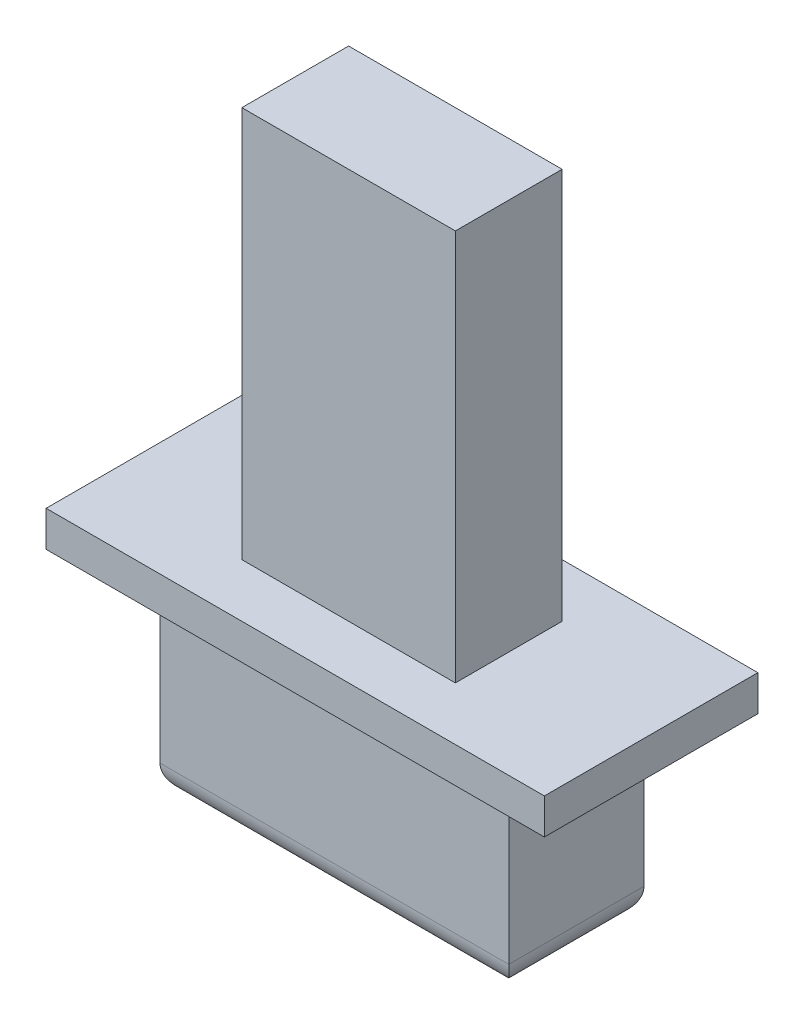
ISO-10303-21;
HEADER;
FILE_DESCRIPTION(('STEP AP214'),'2;1');
FILE_NAME('part.step','',(''),(''),'','','');
FILE_SCHEMA(('AUTOMOTIVE_DESIGN { 1 0 10303 214 1 1 1 1 }'));
ENDSEC;
DATA;
#1=APPLICATION_CONTEXT('core data for automotive mechanical design processes');
#2=APPLICATION_PROTOCOL_DEFINITION('international standard','automotive_design',2000,#1);
#3=PRODUCT_CONTEXT('',#1,'mechanical');
#4=PRODUCT('Part','Part','',(#3));
#5=PRODUCT_RELATED_PRODUCT_CATEGORY('part','',(#4));
#6=PRODUCT_DEFINITION_FORMATION('','',#4);
#7=PRODUCT_DEFINITION_CONTEXT('part definition',#1,'design');
#8=PRODUCT_DEFINITION('design','',#6,#7);
#9=PRODUCT_DEFINITION_SHAPE('','',#8);
#10=(LENGTH_UNIT() NAMED_UNIT(*) SI_UNIT(.MILLI.,.METRE.));
#11=(NAMED_UNIT(*) PLANE_ANGLE_UNIT() SI_UNIT($,.RADIAN.));
#12=(NAMED_UNIT(*) SI_UNIT($,.STERADIAN.) SOLID_ANGLE_UNIT());
#13=UNCERTAINTY_MEASURE_WITH_UNIT(LENGTH_MEASURE(1.E-05),#10,'distance_accuracy_value','');
#14=(GEOMETRIC_REPRESENTATION_CONTEXT(3) GLOBAL_UNCERTAINTY_ASSIGNED_CONTEXT((#13)) GLOBAL_UNIT_ASSIGNED_CONTEXT((#10,
#11,#12)) REPRESENTATION_CONTEXT('',''));
#15=CARTESIAN_POINT('',(0.,0.,0.));
#16=DIRECTION('',(0.,0.,1.));
#17=DIRECTION('',(1.,0.,0.));
#18=AXIS2_PLACEMENT_3D('',#15,#16,#17);
#19=CARTESIAN_POINT('',(3.5,3.25,1.5));
#20=DIRECTION('',(-1.,0.,0.));
#21=DIRECTION('',(0.,0.,1.));
#22=AXIS2_PLACEMENT_3D('',#19,#20,#21);
#23=PLANE('',#22);
#24=DIRECTION('',(0.,0.,-1.));
#25=VECTOR('',#24,1.);
#26=CARTESIAN_POINT('',(3.5,2.75,1.5));
#27=LINE('',#26,#25);
#28=CARTESIAN_POINT('',(3.5,2.75,1.5));
#29=VERTEX_POINT('',#28);
#30=CARTESIAN_POINT('',(3.5,2.75,-1.5));
#31=VERTEX_POINT('',#30);
#32=EDGE_CURVE('E110',#29,#31,#27,.T.);
#33=ORIENTED_EDGE('',*,*,#32,.T.);
#34=DIRECTION('',(0.,-1.,0.));
#35=VECTOR('',#34,1.);
#36=CARTESIAN_POINT('',(3.5,3.25,-1.5));
#37=LINE('',#36,#35);
#38=CARTESIAN_POINT('',(3.5,3.25,-1.5));
#39=VERTEX_POINT('',#38);
#40=EDGE_CURVE('E12',#39,#31,#37,.T.);
#41=ORIENTED_EDGE('',*,*,#40,.F.);
#42=DIRECTION('',(0.,0.,-1.));
#43=VECTOR('',#42,1.);
#44=CARTESIAN_POINT('',(3.5,3.25,1.5));
#45=LINE('',#44,#43);
#46=CARTESIAN_POINT('',(3.5,3.25,1.5));
#47=VERTEX_POINT('',#46);
#48=EDGE_CURVE('E98',#47,#39,#45,.T.);
#49=ORIENTED_EDGE('',*,*,#48,.F.);
#50=DIRECTION('',(0.,-1.,0.));
#51=VECTOR('',#50,1.);
#52=CARTESIAN_POINT('',(3.5,3.25,1.5));
#53=LINE('',#52,#51);
#54=EDGE_CURVE('E106',#47,#29,#53,.T.);
#55=ORIENTED_EDGE('',*,*,#54,.T.);
#56=EDGE_LOOP('',(#33,#41,#49,#55));
#57=FACE_BOUND('',#56,.T.);
#58=ADVANCED_FACE('F47',(#57),#23,.F.);
#59=CARTESIAN_POINT('',(-3.5,3.25,-1.5));
#60=DIRECTION('',(0.,0.,1.));
#61=DIRECTION('',(1.,0.,0.));
#62=AXIS2_PLACEMENT_3D('',#59,#60,#61);
#63=PLANE('',#62);
#64=DIRECTION('',(-1.,0.,0.));
#65=VECTOR('',#64,1.);
#66=CARTESIAN_POINT('',(-3.5,2.75,-1.5));
#67=LINE('',#66,#65);
#68=CARTESIAN_POINT('',(-3.5,2.75,-1.5));
#69=VERTEX_POINT('',#68);
#70=EDGE_CURVE('E102',#31,#69,#67,.T.);
#71=ORIENTED_EDGE('',*,*,#70,.T.);
#72=DIRECTION('',(0.,-1.,0.));
#73=VECTOR('',#72,1.);
#74=CARTESIAN_POINT('',(-3.5,3.25,-1.5));
#75=LINE('',#74,#73);
#76=CARTESIAN_POINT('',(-3.5,3.25,-1.5));
#77=VERTEX_POINT('',#76);
#78=EDGE_CURVE('E55',#77,#69,#75,.T.);
#79=ORIENTED_EDGE('',*,*,#78,.F.);
#80=DIRECTION('',(-1.,0.,0.));
#81=VECTOR('',#80,1.);
#82=CARTESIAN_POINT('',(-3.5,3.25,-1.5));
#83=LINE('',#82,#81);
#84=EDGE_CURVE('E93',#39,#77,#83,.T.);
#85=ORIENTED_EDGE('',*,*,#84,.F.);
#86=ORIENTED_EDGE('',*,*,#40,.T.);
#87=EDGE_LOOP('',(#71,#79,#85,#86));
#88=FACE_BOUND('',#87,.T.);
#89=ADVANCED_FACE('F101',(#88),#63,.F.);
#90=CARTESIAN_POINT('',(-3.5,3.25,1.5));
#91=DIRECTION('',(1.,0.,0.));
#92=DIRECTION('',(0.,0.,-1.));
#93=AXIS2_PLACEMENT_3D('',#90,#91,#92);
#94=PLANE('',#93);
#95=DIRECTION('',(0.,0.,1.));
#96=VECTOR('',#95,1.);
#97=CARTESIAN_POINT('',(-3.5,2.75,1.5));
#98=LINE('',#97,#96);
#99=CARTESIAN_POINT('',(-3.5,2.75,1.5));
#100=VERTEX_POINT('',#99);
#101=EDGE_CURVE('E80',#69,#100,#98,.T.);
#102=ORIENTED_EDGE('',*,*,#101,.T.);
#103=DIRECTION('',(0.,-1.,0.));
#104=VECTOR('',#103,1.);
#105=CARTESIAN_POINT('',(-3.5,3.25,1.5));
#106=LINE('',#105,#104);
#107=CARTESIAN_POINT('',(-3.5,3.25,1.5));
#108=VERTEX_POINT('',#107);
#109=EDGE_CURVE('E103',#108,#100,#106,.T.);
#110=ORIENTED_EDGE('',*,*,#109,.F.);
#111=DIRECTION('',(0.,0.,1.));
#112=VECTOR('',#111,1.);
#113=CARTESIAN_POINT('',(-3.5,3.25,1.5));
#114=LINE('',#113,#112);
#115=EDGE_CURVE('E96',#77,#108,#114,.T.);
#116=ORIENTED_EDGE('',*,*,#115,.F.);
#117=ORIENTED_EDGE('',*,*,#78,.T.);
#118=EDGE_LOOP('',(#102,#110,#116,#117));
#119=FACE_BOUND('',#118,.T.);
#120=ADVANCED_FACE('F104',(#119),#94,.F.);
#121=CARTESIAN_POINT('',(-3.5,3.25,1.5));
#122=DIRECTION('',(0.,0.,-1.));
#123=DIRECTION('',(-1.,0.,0.));
#124=AXIS2_PLACEMENT_3D('',#121,#122,#123);
#125=PLANE('',#124);
#126=DIRECTION('',(1.,0.,0.));
#127=VECTOR('',#126,1.);
#128=CARTESIAN_POINT('',(-3.5,2.75,1.5));
#129=LINE('',#128,#127);
#130=EDGE_CURVE('E86',#100,#29,#129,.T.);
#131=ORIENTED_EDGE('',*,*,#130,.T.);
#132=ORIENTED_EDGE('',*,*,#54,.F.);
#133=DIRECTION('',(1.,0.,0.));
#134=VECTOR('',#133,1.);
#135=CARTESIAN_POINT('',(-3.5,3.25,1.5));
#136=LINE('',#135,#134);
#137=EDGE_CURVE('E63',#108,#47,#136,.T.);
#138=ORIENTED_EDGE('',*,*,#137,.F.);
#139=ORIENTED_EDGE('',*,*,#109,.T.);
#140=EDGE_LOOP('',(#131,#132,#138,#139));
#141=FACE_BOUND('',#140,.T.);
#142=ADVANCED_FACE('F117',(#141),#125,.F.);
#143=CARTESIAN_POINT('',(0.,3.25,0.));
#144=DIRECTION('',(0.,-1.,0.));
#145=DIRECTION('',(0.,0.,-1.));
#146=AXIS2_PLACEMENT_3D('',#143,#144,#145);
#147=PLANE('',#146);
#148=ORIENTED_EDGE('',*,*,#48,.T.);
#149=ORIENTED_EDGE('',*,*,#84,.T.);
#150=ORIENTED_EDGE('',*,*,#115,.T.);
#151=ORIENTED_EDGE('',*,*,#137,.T.);
#152=EDGE_LOOP('',(#148,#149,#150,#151));
#153=FACE_BOUND('',#152,.T.);
#154=ADVANCED_FACE('F94',(#153),#147,.F.);
#155=CARTESIAN_POINT('',(0.,2.75,0.));
#156=DIRECTION('',(0.,-1.,0.));
#157=DIRECTION('',(0.,0.,-1.));
#158=AXIS2_PLACEMENT_3D('',#155,#156,#157);
#159=PLANE('',#158);
#160=ORIENTED_EDGE('',*,*,#32,.F.);
#161=ORIENTED_EDGE('',*,*,#130,.F.);
#162=ORIENTED_EDGE('',*,*,#101,.F.);
#163=ORIENTED_EDGE('',*,*,#70,.F.);
#164=EDGE_LOOP('',(#160,#161,#162,#163));
#165=FACE_BOUND('',#164,.T.);
#166=ADVANCED_FACE('F120',(#165),#159,.T.);
#167=CLOSED_SHELL('',(#58,#89,#120,#142,#154,#166));
#168=MANIFOLD_SOLID_BREP('B2',#167);
#169=CARTESIAN_POINT('',(-2.45,2.75,0.95));
#170=DIRECTION('',(1.,0.,0.));
#171=DIRECTION('',(0.,0.,-1.));
#172=AXIS2_PLACEMENT_3D('',#169,#170,#171);
#173=PLANE('',#172);
#174=DIRECTION('',(0.,-1.,0.));
#175=VECTOR('',#174,1.);
#176=CARTESIAN_POINT('',(-2.45,2.75,-0.95));
#177=LINE('',#176,#175);
#178=CARTESIAN_POINT('',(-2.45,2.75,-0.95));
#179=VERTEX_POINT('',#178);
#180=CARTESIAN_POINT('',(-2.45,0.4,-0.95));
#181=VERTEX_POINT('',#180);
#182=EDGE_CURVE('E290',#179,#181,#177,.T.);
#183=ORIENTED_EDGE('',*,*,#182,.T.);
#184=DIRECTION('',(0.,0.,1.));
#185=VECTOR('',#184,1.);
#186=CARTESIAN_POINT('',(-2.45,0.4,0.95));
#187=LINE('',#186,#185);
#188=CARTESIAN_POINT('',(-2.45,0.4,0.95));
#189=VERTEX_POINT('',#188);
#190=EDGE_CURVE('E45',#181,#189,#187,.T.);
#191=ORIENTED_EDGE('',*,*,#190,.T.);
#192=DIRECTION('',(0.,-1.,0.));
#193=VECTOR('',#192,1.);
#194=CARTESIAN_POINT('',(-2.45,2.75,0.95));
#195=LINE('',#194,#193);
#196=CARTESIAN_POINT('',(-2.45,2.75,0.95));
#197=VERTEX_POINT('',#196);
#198=EDGE_CURVE('E296',#197,#189,#195,.T.);
#199=ORIENTED_EDGE('',*,*,#198,.F.);
#200=DIRECTION('',(0.,0.,1.));
#201=VECTOR('',#200,1.);
#202=CARTESIAN_POINT('',(-2.45,2.75,0.95));
#203=LINE('',#202,#201);
#204=EDGE_CURVE('E276',#179,#197,#203,.T.);
#205=ORIENTED_EDGE('',*,*,#204,.F.);
#206=EDGE_LOOP('',(#183,#191,#199,#205));
#207=FACE_BOUND('',#206,.T.);
#208=ADVANCED_FACE('F171',(#207),#173,.F.);
#209=CARTESIAN_POINT('',(2.45,2.75,0.95));
#210=DIRECTION('',(0.,0.,-1.));
#211=DIRECTION('',(-1.,0.,0.));
#212=AXIS2_PLACEMENT_3D('',#209,#210,#211);
#213=PLANE('',#212);
#214=ORIENTED_EDGE('',*,*,#198,.T.);
#215=DIRECTION('',(1.,0.,0.));
#216=VECTOR('',#215,1.);
#217=CARTESIAN_POINT('',(2.45,0.4,0.95));
#218=LINE('',#217,#216);
#219=CARTESIAN_POINT('',(2.45,0.4,0.95));
#220=VERTEX_POINT('',#219);
#221=EDGE_CURVE('E299',#189,#220,#218,.T.);
#222=ORIENTED_EDGE('',*,*,#221,.T.);
#223=DIRECTION('',(0.,-1.,0.));
#224=VECTOR('',#223,1.);
#225=CARTESIAN_POINT('',(2.45,2.75,0.95));
#226=LINE('',#225,#224);
#227=CARTESIAN_POINT('',(2.45,2.75,0.95));
#228=VERTEX_POINT('',#227);
#229=EDGE_CURVE('E294',#228,#220,#226,.T.);
#230=ORIENTED_EDGE('',*,*,#229,.F.);
#231=DIRECTION('',(1.,0.,0.));
#232=VECTOR('',#231,1.);
#233=CARTESIAN_POINT('',(2.45,2.75,0.95));
#234=LINE('',#233,#232);
#235=EDGE_CURVE('E279',#197,#228,#234,.T.);
#236=ORIENTED_EDGE('',*,*,#235,.F.);
#237=EDGE_LOOP('',(#214,#222,#230,#236));
#238=FACE_BOUND('',#237,.T.);
#239=ADVANCED_FACE('F358',(#238),#213,.F.);
#240=CARTESIAN_POINT('',(2.45,2.75,0.95));
#241=DIRECTION('',(-1.,0.,0.));
#242=DIRECTION('',(0.,0.,1.));
#243=AXIS2_PLACEMENT_3D('',#240,#241,#242);
#244=PLANE('',#243);
#245=ORIENTED_EDGE('',*,*,#229,.T.);
#246=DIRECTION('',(0.,0.,-1.));
#247=VECTOR('',#246,1.);
#248=CARTESIAN_POINT('',(2.45,0.4,0.95));
#249=LINE('',#248,#247);
#250=CARTESIAN_POINT('',(2.45,0.4,-0.95));
#251=VERTEX_POINT('',#250);
#252=EDGE_CURVE('E195',#220,#251,#249,.T.);
#253=ORIENTED_EDGE('',*,*,#252,.T.);
#254=DIRECTION('',(0.,-1.,0.));
#255=VECTOR('',#254,1.);
#256=CARTESIAN_POINT('',(2.45,2.75,-0.95));
#257=LINE('',#256,#255);
#258=CARTESIAN_POINT('',(2.45,2.75,-0.95));
#259=VERTEX_POINT('',#258);
#260=EDGE_CURVE('E292',#259,#251,#257,.T.);
#261=ORIENTED_EDGE('',*,*,#260,.F.);
#262=DIRECTION('',(0.,0.,-1.));
#263=VECTOR('',#262,1.);
#264=CARTESIAN_POINT('',(2.45,2.75,0.95));
#265=LINE('',#264,#263);
#266=EDGE_CURVE('E286',#228,#259,#265,.T.);
#267=ORIENTED_EDGE('',*,*,#266,.F.);
#268=EDGE_LOOP('',(#245,#253,#261,#267));
#269=FACE_BOUND('',#268,.T.);
#270=ADVANCED_FACE('F378',(#269),#244,.F.);
#271=CARTESIAN_POINT('',(2.45,2.75,-0.95));
#272=DIRECTION('',(0.,0.,1.));
#273=DIRECTION('',(1.,0.,0.));
#274=AXIS2_PLACEMENT_3D('',#271,#272,#273);
#275=PLANE('',#274);
#276=ORIENTED_EDGE('',*,*,#260,.T.);
#277=DIRECTION('',(-1.,0.,0.));
#278=VECTOR('',#277,1.);
#279=CARTESIAN_POINT('',(2.45,0.4,-0.95));
#280=LINE('',#279,#278);
#281=EDGE_CURVE('E180',#251,#181,#280,.T.);
#282=ORIENTED_EDGE('',*,*,#281,.T.);
#283=ORIENTED_EDGE('',*,*,#182,.F.);
#284=DIRECTION('',(-1.,0.,0.));
#285=VECTOR('',#284,1.);
#286=CARTESIAN_POINT('',(2.45,2.75,-0.95));
#287=LINE('',#286,#285);
#288=EDGE_CURVE('E288',#259,#179,#287,.T.);
#289=ORIENTED_EDGE('',*,*,#288,.F.);
#290=EDGE_LOOP('',(#276,#282,#283,#289));
#291=FACE_BOUND('',#290,.T.);
#292=ADVANCED_FACE('F349',(#291),#275,.F.);
#293=CARTESIAN_POINT('',(0.,2.75,0.));
#294=DIRECTION('',(0.,1.,0.));
#295=DIRECTION('',(0.,0.,1.));
#296=AXIS2_PLACEMENT_3D('',#293,#294,#295);
#297=PLANE('',#296);
#298=DIRECTION('',(0.,0.,1.));
#299=VECTOR('',#298,1.);
#300=CARTESIAN_POINT('',(-1.5,2.75,-0.75));
#301=LINE('',#300,#299);
#302=CARTESIAN_POINT('',(-1.5,2.75,-0.75));
#303=VERTEX_POINT('',#302);
#304=CARTESIAN_POINT('',(-1.5,2.75,0.75));
#305=VERTEX_POINT('',#304);
#306=EDGE_CURVE('E275',#303,#305,#301,.T.);
#307=ORIENTED_EDGE('',*,*,#306,.F.);
#308=DIRECTION('',(-1.,0.,0.));
#309=VECTOR('',#308,1.);
#310=CARTESIAN_POINT('',(1.5,2.75,-0.75));
#311=LINE('',#310,#309);
#312=CARTESIAN_POINT('',(1.5,2.75,-0.75));
#313=VERTEX_POINT('',#312);
#314=EDGE_CURVE('E272',#313,#303,#311,.T.);
#315=ORIENTED_EDGE('',*,*,#314,.F.);
#316=DIRECTION('',(0.,0.,-1.));
#317=VECTOR('',#316,1.);
#318=CARTESIAN_POINT('',(1.5,2.75,-0.75));
#319=LINE('',#318,#317);
#320=CARTESIAN_POINT('',(1.5,2.75,0.75));
#321=VERTEX_POINT('',#320);
#322=EDGE_CURVE('E328',#321,#313,#319,.T.);
#323=ORIENTED_EDGE('',*,*,#322,.F.);
#324=DIRECTION('',(1.,0.,0.));
#325=VECTOR('',#324,1.);
#326=CARTESIAN_POINT('',(1.5,2.75,0.75));
#327=LINE('',#326,#325);
#328=EDGE_CURVE('E326',#305,#321,#327,.T.);
#329=ORIENTED_EDGE('',*,*,#328,.F.);
#330=EDGE_LOOP('',(#307,#315,#323,#329));
#331=FACE_BOUND('',#330,.T.);
#332=ORIENTED_EDGE('',*,*,#204,.T.);
#333=ORIENTED_EDGE('',*,*,#235,.T.);
#334=ORIENTED_EDGE('',*,*,#266,.T.);
#335=ORIENTED_EDGE('',*,*,#288,.T.);
#336=EDGE_LOOP('',(#332,#333,#334,#335));
#337=FACE_BOUND('',#336,.T.);
#338=ADVANCED_FACE('F345',(#331,#337),#297,.T.);
#339=CARTESIAN_POINT('',(0.,0.,0.));
#340=DIRECTION('',(0.,1.,0.));
#341=DIRECTION('',(0.,0.,1.));
#342=AXIS2_PLACEMENT_3D('',#339,#340,#341);
#343=PLANE('',#342);
#344=DIRECTION('',(0.,0.,-1.));
#345=VECTOR('',#344,1.);
#346=CARTESIAN_POINT('',(2.05,0.,0.));
#347=LINE('',#346,#345);
#348=CARTESIAN_POINT('',(2.05,0.,-0.55));
#349=VERTEX_POINT('',#348);
#350=CARTESIAN_POINT('',(2.05,0.,0.55));
#351=VERTEX_POINT('',#350);
#352=EDGE_CURVE('E306',#349,#351,#347,.F.);
#353=ORIENTED_EDGE('',*,*,#352,.T.);
#354=DIRECTION('',(1.,0.,0.));
#355=VECTOR('',#354,1.);
#356=CARTESIAN_POINT('',(0.,0.,0.55));
#357=LINE('',#356,#355);
#358=CARTESIAN_POINT('',(-2.05,0.,0.55));
#359=VERTEX_POINT('',#358);
#360=EDGE_CURVE('E308',#351,#359,#357,.F.);
#361=ORIENTED_EDGE('',*,*,#360,.T.);
#362=DIRECTION('',(0.,0.,1.));
#363=VECTOR('',#362,1.);
#364=CARTESIAN_POINT('',(-2.05,0.,0.));
#365=LINE('',#364,#363);
#366=CARTESIAN_POINT('',(-2.05,0.,-0.55));
#367=VERTEX_POINT('',#366);
#368=EDGE_CURVE('E302',#359,#367,#365,.F.);
#369=ORIENTED_EDGE('',*,*,#368,.T.);
#370=DIRECTION('',(-1.,0.,0.));
#371=VECTOR('',#370,1.);
#372=CARTESIAN_POINT('',(0.,0.,-0.55));
#373=LINE('',#372,#371);
#374=EDGE_CURVE('E304',#367,#349,#373,.F.);
#375=ORIENTED_EDGE('',*,*,#374,.T.);
#376=EDGE_LOOP('',(#353,#361,#369,#375));
#377=FACE_BOUND('',#376,.T.);
#378=ADVANCED_FACE('F348',(#377),#343,.F.);
#379=CARTESIAN_POINT('',(-1.5,8.75,-0.75));
#380=DIRECTION('',(1.,0.,0.));
#381=DIRECTION('',(0.,0.,-1.));
#382=AXIS2_PLACEMENT_3D('',#379,#380,#381);
#383=PLANE('',#382);
#384=ORIENTED_EDGE('',*,*,#306,.T.);
#385=DIRECTION('',(0.,-1.,0.));
#386=VECTOR('',#385,1.);
#387=CARTESIAN_POINT('',(-1.5,8.75,0.75));
#388=LINE('',#387,#386);
#389=CARTESIAN_POINT('',(-1.5,8.75,0.75));
#390=VERTEX_POINT('',#389);
#391=EDGE_CURVE('E256',#390,#305,#388,.T.);
#392=ORIENTED_EDGE('',*,*,#391,.F.);
#393=DIRECTION('',(0.,0.,1.));
#394=VECTOR('',#393,1.);
#395=CARTESIAN_POINT('',(-1.5,8.75,-0.75));
#396=LINE('',#395,#394);
#397=CARTESIAN_POINT('',(-1.5,8.75,-0.75));
#398=VERTEX_POINT('',#397);
#399=EDGE_CURVE('E263',#398,#390,#396,.T.);
#400=ORIENTED_EDGE('',*,*,#399,.F.);
#401=DIRECTION('',(0.,-1.,0.));
#402=VECTOR('',#401,1.);
#403=CARTESIAN_POINT('',(-1.5,8.75,-0.75));
#404=LINE('',#403,#402);
#405=EDGE_CURVE('E337',#398,#303,#404,.T.);
#406=ORIENTED_EDGE('',*,*,#405,.T.);
#407=EDGE_LOOP('',(#384,#392,#400,#406));
#408=FACE_BOUND('',#407,.T.);
#409=ADVANCED_FACE('F274',(#408),#383,.F.);
#410=CARTESIAN_POINT('',(1.5,8.75,0.75));
#411=DIRECTION('',(0.,0.,-1.));
#412=DIRECTION('',(-1.,0.,0.));
#413=AXIS2_PLACEMENT_3D('',#410,#411,#412);
#414=PLANE('',#413);
#415=ORIENTED_EDGE('',*,*,#328,.T.);
#416=DIRECTION('',(0.,-1.,0.));
#417=VECTOR('',#416,1.);
#418=CARTESIAN_POINT('',(1.5,8.75,0.75));
#419=LINE('',#418,#417);
#420=CARTESIAN_POINT('',(1.5,8.75,0.75));
#421=VERTEX_POINT('',#420);
#422=EDGE_CURVE('E259',#421,#321,#419,.T.);
#423=ORIENTED_EDGE('',*,*,#422,.F.);
#424=DIRECTION('',(1.,0.,0.));
#425=VECTOR('',#424,1.);
#426=CARTESIAN_POINT('',(1.5,8.75,0.75));
#427=LINE('',#426,#425);
#428=EDGE_CURVE('E251',#390,#421,#427,.T.);
#429=ORIENTED_EDGE('',*,*,#428,.F.);
#430=ORIENTED_EDGE('',*,*,#391,.T.);
#431=EDGE_LOOP('',(#415,#423,#429,#430));
#432=FACE_BOUND('',#431,.T.);
#433=ADVANCED_FACE('F254',(#432),#414,.F.);
#434=CARTESIAN_POINT('',(1.5,8.75,-0.75));
#435=DIRECTION('',(-1.,0.,0.));
#436=DIRECTION('',(0.,0.,1.));
#437=AXIS2_PLACEMENT_3D('',#434,#435,#436);
#438=PLANE('',#437);
#439=ORIENTED_EDGE('',*,*,#322,.T.);
#440=DIRECTION('',(0.,-1.,0.));
#441=VECTOR('',#440,1.);
#442=CARTESIAN_POINT('',(1.5,8.75,-0.75));
#443=LINE('',#442,#441);
#444=CARTESIAN_POINT('',(1.5,8.75,-0.75));
#445=VERTEX_POINT('',#444);
#446=EDGE_CURVE('E281',#445,#313,#443,.T.);
#447=ORIENTED_EDGE('',*,*,#446,.F.);
#448=DIRECTION('',(0.,0.,-1.));
#449=VECTOR('',#448,1.);
#450=CARTESIAN_POINT('',(1.5,8.75,-0.75));
#451=LINE('',#450,#449);
#452=EDGE_CURVE('E262',#421,#445,#451,.T.);
#453=ORIENTED_EDGE('',*,*,#452,.F.);
#454=ORIENTED_EDGE('',*,*,#422,.T.);
#455=EDGE_LOOP('',(#439,#447,#453,#454));
#456=FACE_BOUND('',#455,.T.);
#457=ADVANCED_FACE('F343',(#456),#438,.F.);
#458=CARTESIAN_POINT('',(1.5,8.75,-0.75));
#459=DIRECTION('',(0.,0.,1.));
#460=DIRECTION('',(1.,0.,0.));
#461=AXIS2_PLACEMENT_3D('',#458,#459,#460);
#462=PLANE('',#461);
#463=ORIENTED_EDGE('',*,*,#314,.T.);
#464=ORIENTED_EDGE('',*,*,#405,.F.);
#465=DIRECTION('',(-1.,0.,0.));
#466=VECTOR('',#465,1.);
#467=CARTESIAN_POINT('',(1.5,8.75,-0.75));
#468=LINE('',#467,#466);
#469=EDGE_CURVE('E268',#445,#398,#468,.T.);
#470=ORIENTED_EDGE('',*,*,#469,.F.);
#471=ORIENTED_EDGE('',*,*,#446,.T.);
#472=EDGE_LOOP('',(#463,#464,#470,#471));
#473=FACE_BOUND('',#472,.T.);
#474=ADVANCED_FACE('F341',(#473),#462,.F.);
#475=CARTESIAN_POINT('',(0.,8.75,0.));
#476=DIRECTION('',(0.,-1.,0.));
#477=DIRECTION('',(0.,0.,-1.));
#478=AXIS2_PLACEMENT_3D('',#475,#476,#477);
#479=PLANE('',#478);
#480=ORIENTED_EDGE('',*,*,#399,.T.);
#481=ORIENTED_EDGE('',*,*,#428,.T.);
#482=ORIENTED_EDGE('',*,*,#452,.T.);
#483=ORIENTED_EDGE('',*,*,#469,.T.);
#484=EDGE_LOOP('',(#480,#481,#482,#483));
#485=FACE_BOUND('',#484,.T.);
#486=ADVANCED_FACE('F266',(#485),#479,.F.);
#487=CARTESIAN_POINT('',(2.45,0.4,-0.55));
#488=DIRECTION('',(-1.,0.,0.));
#489=DIRECTION('',(0.,0.,1.));
#490=AXIS2_PLACEMENT_3D('',#487,#488,#489);
#491=CYLINDRICAL_SURFACE('',#490,0.4);
#492=CARTESIAN_POINT('',(2.05,0.4,-0.55));
#493=DIRECTION('',(-0.707106781186548,0.,-0.707106781186547));
#494=DIRECTION('',(-0.707106781186547,0.,0.707106781186548));
#495=AXIS2_PLACEMENT_3D('',#492,#493,#494);
#496=ELLIPSE('',#495,0.565685424949238,0.4);
#497=EDGE_CURVE('E316',#349,#251,#496,.F.);
#498=ORIENTED_EDGE('',*,*,#497,.F.);
#499=ORIENTED_EDGE('',*,*,#374,.F.);
#500=CARTESIAN_POINT('',(-2.05,0.4,-0.55));
#501=DIRECTION('',(-0.707106781186547,0.,0.707106781186548));
#502=DIRECTION('',(0.707106781186548,0.,0.707106781186547));
#503=AXIS2_PLACEMENT_3D('',#500,#501,#502);
#504=ELLIPSE('',#503,0.565685424949238,0.4);
#505=EDGE_CURVE('E175',#181,#367,#504,.T.);
#506=ORIENTED_EDGE('',*,*,#505,.F.);
#507=ORIENTED_EDGE('',*,*,#281,.F.);
#508=EDGE_LOOP('',(#498,#499,#506,#507));
#509=FACE_BOUND('',#508,.T.);
#510=ADVANCED_FACE('F173',(#509),#491,.T.);
#511=CARTESIAN_POINT('',(-2.05,0.4,0.95));
#512=DIRECTION('',(0.,0.,1.));
#513=DIRECTION('',(1.,0.,0.));
#514=AXIS2_PLACEMENT_3D('',#511,#512,#513);
#515=CYLINDRICAL_SURFACE('',#514,0.4);
#516=ORIENTED_EDGE('',*,*,#505,.T.);
#517=ORIENTED_EDGE('',*,*,#368,.F.);
#518=CARTESIAN_POINT('',(-2.05,0.4,0.55));
#519=DIRECTION('',(0.707106781186548,0.,0.707106781186547));
#520=DIRECTION('',(-0.707106781186547,0.,0.707106781186548));
#521=AXIS2_PLACEMENT_3D('',#518,#519,#520);
#522=ELLIPSE('',#521,0.565685424949238,0.4);
#523=EDGE_CURVE('E315',#189,#359,#522,.T.);
#524=ORIENTED_EDGE('',*,*,#523,.F.);
#525=ORIENTED_EDGE('',*,*,#190,.F.);
#526=EDGE_LOOP('',(#516,#517,#524,#525));
#527=FACE_BOUND('',#526,.T.);
#528=ADVANCED_FACE('F360',(#527),#515,.T.);
#529=CARTESIAN_POINT('',(2.05,0.4,0.95));
#530=DIRECTION('',(0.,0.,-1.));
#531=DIRECTION('',(-1.,0.,0.));
#532=AXIS2_PLACEMENT_3D('',#529,#530,#531);
#533=CYLINDRICAL_SURFACE('',#532,0.4);
#534=ORIENTED_EDGE('',*,*,#497,.T.);
#535=ORIENTED_EDGE('',*,*,#252,.F.);
#536=CARTESIAN_POINT('',(2.05,0.4,0.55));
#537=DIRECTION('',(0.707106781186547,0.,-0.707106781186548));
#538=DIRECTION('',(-0.707106781186548,0.,-0.707106781186547));
#539=AXIS2_PLACEMENT_3D('',#536,#537,#538);
#540=ELLIPSE('',#539,0.565685424949238,0.4);
#541=EDGE_CURVE('E313',#351,#220,#540,.F.);
#542=ORIENTED_EDGE('',*,*,#541,.F.);
#543=ORIENTED_EDGE('',*,*,#352,.F.);
#544=EDGE_LOOP('',(#534,#535,#542,#543));
#545=FACE_BOUND('',#544,.T.);
#546=ADVANCED_FACE('F365',(#545),#533,.T.);
#547=CARTESIAN_POINT('',(2.45,0.4,0.55));
#548=DIRECTION('',(1.,0.,0.));
#549=DIRECTION('',(0.,0.,-1.));
#550=AXIS2_PLACEMENT_3D('',#547,#548,#549);
#551=CYLINDRICAL_SURFACE('',#550,0.4);
#552=ORIENTED_EDGE('',*,*,#523,.T.);
#553=ORIENTED_EDGE('',*,*,#360,.F.);
#554=ORIENTED_EDGE('',*,*,#541,.T.);
#555=ORIENTED_EDGE('',*,*,#221,.F.);
#556=EDGE_LOOP('',(#552,#553,#554,#555));
#557=FACE_BOUND('',#556,.T.);
#558=ADVANCED_FACE('F363',(#557),#551,.T.);
#559=CLOSED_SHELL('',(#208,#239,#270,#292,#338,#378,#409,#433,#457,#474,#486,#510,#528,#546,#558));
#560=MANIFOLD_SOLID_BREP('B6',#559);
#561=ADVANCED_BREP_SHAPE_REPRESENTATION('',(#18,#168,#560),#14);
#562=SHAPE_DEFINITION_REPRESENTATION(#9,#561);
ENDSEC;
END-ISO-10303-21;
